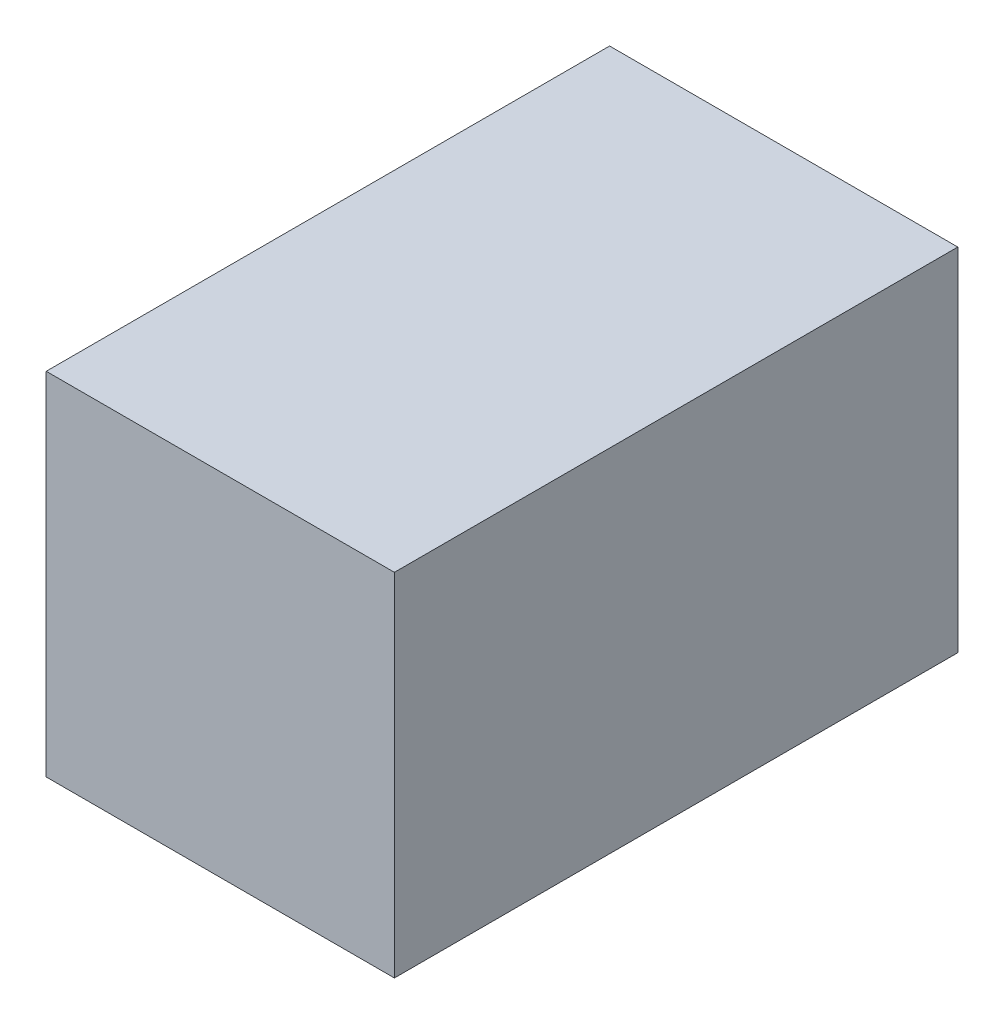
ISO-10303-21;
HEADER;
FILE_DESCRIPTION(('STEP AP214'),'2;1');
FILE_NAME('part.step','',(''),(''),'','','');
FILE_SCHEMA(('AUTOMOTIVE_DESIGN { 1 0 10303 214 1 1 1 1 }'));
ENDSEC;
DATA;
#1=APPLICATION_CONTEXT('core data for automotive mechanical design processes');
#2=APPLICATION_PROTOCOL_DEFINITION('international standard','automotive_design',2000,#1);
#3=PRODUCT_CONTEXT('',#1,'mechanical');
#4=PRODUCT('Part','Part','',(#3));
#5=PRODUCT_RELATED_PRODUCT_CATEGORY('part','',(#4));
#6=PRODUCT_DEFINITION_FORMATION('','',#4);
#7=PRODUCT_DEFINITION_CONTEXT('part definition',#1,'design');
#8=PRODUCT_DEFINITION('design','',#6,#7);
#9=PRODUCT_DEFINITION_SHAPE('','',#8);
#10=(LENGTH_UNIT() NAMED_UNIT(*) SI_UNIT(.MILLI.,.METRE.));
#11=(NAMED_UNIT(*) PLANE_ANGLE_UNIT() SI_UNIT($,.RADIAN.));
#12=(NAMED_UNIT(*) SI_UNIT($,.STERADIAN.) SOLID_ANGLE_UNIT());
#13=UNCERTAINTY_MEASURE_WITH_UNIT(LENGTH_MEASURE(1.E-05),#10,'distance_accuracy_value','');
#14=(GEOMETRIC_REPRESENTATION_CONTEXT(3) GLOBAL_UNCERTAINTY_ASSIGNED_CONTEXT((#13)) GLOBAL_UNIT_ASSIGNED_CONTEXT((#10,
#11,#12)) REPRESENTATION_CONTEXT('',''));
#15=CARTESIAN_POINT('',(0.,0.,0.));
#16=DIRECTION('',(0.,0.,1.));
#17=DIRECTION('',(1.,0.,0.));
#18=AXIS2_PLACEMENT_3D('',#15,#16,#17);
#19=CARTESIAN_POINT('',(0.,49.5554,0.));
#20=DIRECTION('',(1.,0.,0.));
#21=DIRECTION('',(0.,0.,-1.));
#22=AXIS2_PLACEMENT_3D('',#19,#20,#21);
#23=PLANE('',#22);
#24=DIRECTION('',(0.,0.,1.));
#25=VECTOR('',#24,1.);
#26=CARTESIAN_POINT('',(0.,0.,0.));
#27=LINE('',#26,#25);
#28=CARTESIAN_POINT('',(0.,0.,-79.4639));
#29=VERTEX_POINT('',#28);
#30=CARTESIAN_POINT('',(0.,0.,0.));
#31=VERTEX_POINT('',#30);
#32=EDGE_CURVE('E96',#29,#31,#27,.T.);
#33=ORIENTED_EDGE('',*,*,#32,.T.);
#34=DIRECTION('',(0.,-1.,0.));
#35=VECTOR('',#34,1.);
#36=CARTESIAN_POINT('',(0.,49.5554,0.));
#37=LINE('',#36,#35);
#38=CARTESIAN_POINT('',(0.,49.5554,0.));
#39=VERTEX_POINT('',#38);
#40=EDGE_CURVE('E11',#39,#31,#37,.T.);
#41=ORIENTED_EDGE('',*,*,#40,.F.);
#42=DIRECTION('',(0.,0.,1.));
#43=VECTOR('',#42,1.);
#44=CARTESIAN_POINT('',(0.,49.5554,0.));
#45=LINE('',#44,#43);
#46=CARTESIAN_POINT('',(0.,49.5554,-79.4639));
#47=VERTEX_POINT('',#46);
#48=EDGE_CURVE('E84',#47,#39,#45,.T.);
#49=ORIENTED_EDGE('',*,*,#48,.F.);
#50=DIRECTION('',(0.,-1.,0.));
#51=VECTOR('',#50,1.);
#52=CARTESIAN_POINT('',(0.,49.5554,-79.4639));
#53=LINE('',#52,#51);
#54=EDGE_CURVE('E92',#47,#29,#53,.T.);
#55=ORIENTED_EDGE('',*,*,#54,.T.);
#56=EDGE_LOOP('',(#33,#41,#49,#55));
#57=FACE_BOUND('',#56,.T.);
#58=ADVANCED_FACE('F33',(#57),#23,.F.);
#59=CARTESIAN_POINT('',(0.,49.5554,0.));
#60=DIRECTION('',(0.,0.,-1.));
#61=DIRECTION('',(-1.,0.,0.));
#62=AXIS2_PLACEMENT_3D('',#59,#60,#61);
#63=PLANE('',#62);
#64=DIRECTION('',(1.,0.,0.));
#65=VECTOR('',#64,1.);
#66=CARTESIAN_POINT('',(0.,0.,0.));
#67=LINE('',#66,#65);
#68=CARTESIAN_POINT('',(49.1109,0.,0.));
#69=VERTEX_POINT('',#68);
#70=EDGE_CURVE('E88',#31,#69,#67,.T.);
#71=ORIENTED_EDGE('',*,*,#70,.T.);
#72=DIRECTION('',(0.,-1.,0.));
#73=VECTOR('',#72,1.);
#74=CARTESIAN_POINT('',(49.1109,49.5554,0.));
#75=LINE('',#74,#73);
#76=CARTESIAN_POINT('',(49.1109,49.5554,0.));
#77=VERTEX_POINT('',#76);
#78=EDGE_CURVE('E41',#77,#69,#75,.T.);
#79=ORIENTED_EDGE('',*,*,#78,.F.);
#80=DIRECTION('',(1.,0.,0.));
#81=VECTOR('',#80,1.);
#82=CARTESIAN_POINT('',(0.,49.5554,0.));
#83=LINE('',#82,#81);
#84=EDGE_CURVE('E79',#39,#77,#83,.T.);
#85=ORIENTED_EDGE('',*,*,#84,.F.);
#86=ORIENTED_EDGE('',*,*,#40,.T.);
#87=EDGE_LOOP('',(#71,#79,#85,#86));
#88=FACE_BOUND('',#87,.T.);
#89=ADVANCED_FACE('F87',(#88),#63,.F.);
#90=CARTESIAN_POINT('',(49.1109,49.5554,0.));
#91=DIRECTION('',(-1.,0.,0.));
#92=DIRECTION('',(0.,0.,1.));
#93=AXIS2_PLACEMENT_3D('',#90,#91,#92);
#94=PLANE('',#93);
#95=DIRECTION('',(0.,0.,-1.));
#96=VECTOR('',#95,1.);
#97=CARTESIAN_POINT('',(49.1109,0.,0.));
#98=LINE('',#97,#96);
#99=CARTESIAN_POINT('',(49.1109,0.,-79.4639));
#100=VERTEX_POINT('',#99);
#101=EDGE_CURVE('E66',#69,#100,#98,.T.);
#102=ORIENTED_EDGE('',*,*,#101,.T.);
#103=DIRECTION('',(0.,-1.,0.));
#104=VECTOR('',#103,1.);
#105=CARTESIAN_POINT('',(49.1109,49.5554,-79.4639));
#106=LINE('',#105,#104);
#107=CARTESIAN_POINT('',(49.1109,49.5554,-79.4639));
#108=VERTEX_POINT('',#107);
#109=EDGE_CURVE('E89',#108,#100,#106,.T.);
#110=ORIENTED_EDGE('',*,*,#109,.F.);
#111=DIRECTION('',(0.,0.,-1.));
#112=VECTOR('',#111,1.);
#113=CARTESIAN_POINT('',(49.1109,49.5554,0.));
#114=LINE('',#113,#112);
#115=EDGE_CURVE('E82',#77,#108,#114,.T.);
#116=ORIENTED_EDGE('',*,*,#115,.F.);
#117=ORIENTED_EDGE('',*,*,#78,.T.);
#118=EDGE_LOOP('',(#102,#110,#116,#117));
#119=FACE_BOUND('',#118,.T.);
#120=ADVANCED_FACE('F90',(#119),#94,.F.);
#121=CARTESIAN_POINT('',(0.,49.5554,-79.4639));
#122=DIRECTION('',(0.,0.,1.));
#123=DIRECTION('',(1.,0.,0.));
#124=AXIS2_PLACEMENT_3D('',#121,#122,#123);
#125=PLANE('',#124);
#126=DIRECTION('',(-1.,0.,0.));
#127=VECTOR('',#126,1.);
#128=CARTESIAN_POINT('',(0.,0.,-79.4639));
#129=LINE('',#128,#127);
#130=EDGE_CURVE('E72',#100,#29,#129,.T.);
#131=ORIENTED_EDGE('',*,*,#130,.T.);
#132=ORIENTED_EDGE('',*,*,#54,.F.);
#133=DIRECTION('',(-1.,0.,0.));
#134=VECTOR('',#133,1.);
#135=CARTESIAN_POINT('',(0.,49.5554,-79.4639));
#136=LINE('',#135,#134);
#137=EDGE_CURVE('E49',#108,#47,#136,.T.);
#138=ORIENTED_EDGE('',*,*,#137,.F.);
#139=ORIENTED_EDGE('',*,*,#109,.T.);
#140=EDGE_LOOP('',(#131,#132,#138,#139));
#141=FACE_BOUND('',#140,.T.);
#142=ADVANCED_FACE('F103',(#141),#125,.F.);
#143=CARTESIAN_POINT('',(0.,49.5554,0.));
#144=DIRECTION('',(0.,-1.,0.));
#145=DIRECTION('',(0.,0.,-1.));
#146=AXIS2_PLACEMENT_3D('',#143,#144,#145);
#147=PLANE('',#146);
#148=ORIENTED_EDGE('',*,*,#48,.T.);
#149=ORIENTED_EDGE('',*,*,#84,.T.);
#150=ORIENTED_EDGE('',*,*,#115,.T.);
#151=ORIENTED_EDGE('',*,*,#137,.T.);
#152=EDGE_LOOP('',(#148,#149,#150,#151));
#153=FACE_BOUND('',#152,.T.);
#154=ADVANCED_FACE('F80',(#153),#147,.F.);
#155=CARTESIAN_POINT('',(0.,0.,0.));
#156=DIRECTION('',(0.,-1.,0.));
#157=DIRECTION('',(0.,0.,-1.));
#158=AXIS2_PLACEMENT_3D('',#155,#156,#157);
#159=PLANE('',#158);
#160=ORIENTED_EDGE('',*,*,#32,.F.);
#161=ORIENTED_EDGE('',*,*,#130,.F.);
#162=ORIENTED_EDGE('',*,*,#101,.F.);
#163=ORIENTED_EDGE('',*,*,#70,.F.);
#164=EDGE_LOOP('',(#160,#161,#162,#163));
#165=FACE_BOUND('',#164,.T.);
#166=ADVANCED_FACE('F106',(#165),#159,.T.);
#167=CLOSED_SHELL('',(#58,#89,#120,#142,#154,#166));
#168=MANIFOLD_SOLID_BREP('B2',#167);
#169=ADVANCED_BREP_SHAPE_REPRESENTATION('',(#18,#168),#14);
#170=SHAPE_DEFINITION_REPRESENTATION(#9,#169);
ENDSEC;
END-ISO-10303-21;
